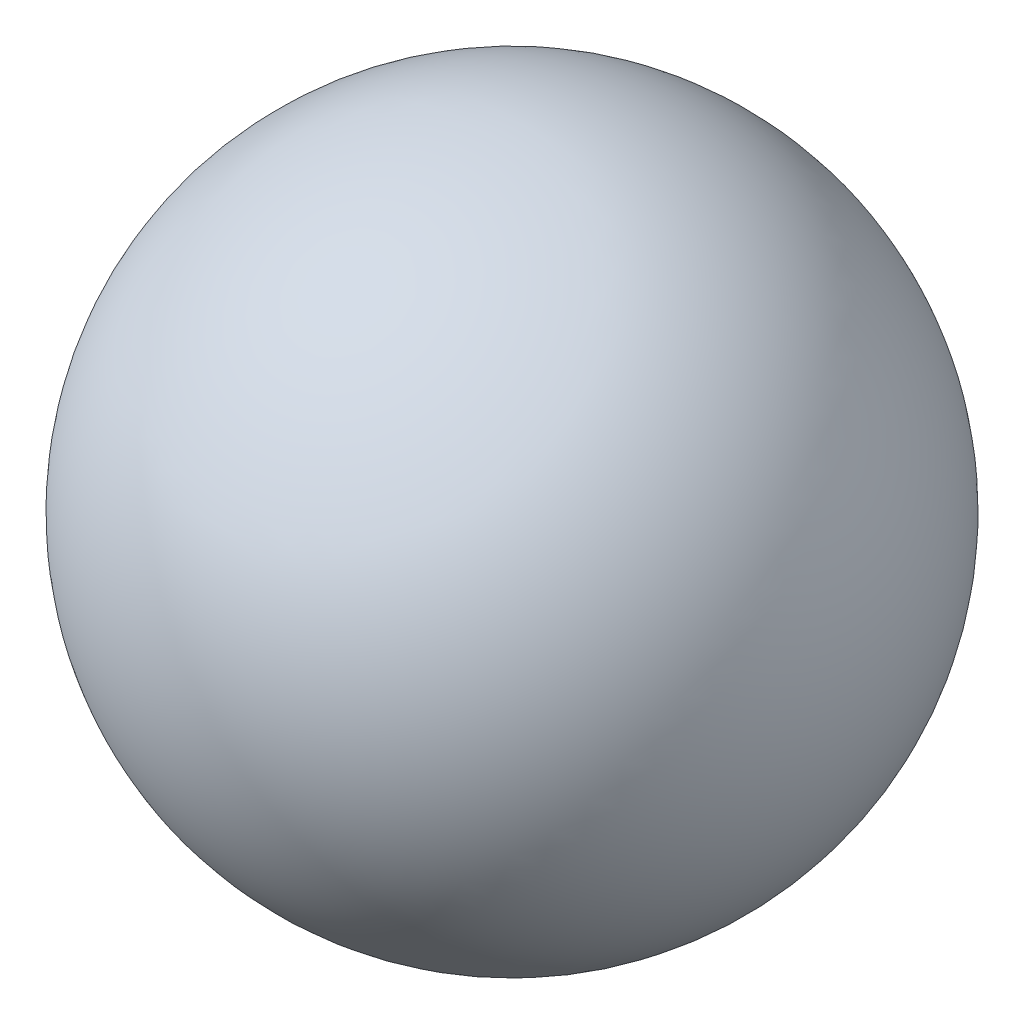
ISO-10303-21;
HEADER;
FILE_DESCRIPTION(('STEP AP214'),'2;1');
FILE_NAME('part.step','',(''),(''),'','','');
FILE_SCHEMA(('AUTOMOTIVE_DESIGN { 1 0 10303 214 1 1 1 1 }'));
ENDSEC;
DATA;
#1=APPLICATION_CONTEXT('core data for automotive mechanical design processes');
#2=APPLICATION_PROTOCOL_DEFINITION('international standard','automotive_design',2000,#1);
#3=PRODUCT_CONTEXT('',#1,'mechanical');
#4=PRODUCT('Part','Part','',(#3));
#5=PRODUCT_RELATED_PRODUCT_CATEGORY('part','',(#4));
#6=PRODUCT_DEFINITION_FORMATION('','',#4);
#7=PRODUCT_DEFINITION_CONTEXT('part definition',#1,'design');
#8=PRODUCT_DEFINITION('design','',#6,#7);
#9=PRODUCT_DEFINITION_SHAPE('','',#8);
#10=(LENGTH_UNIT() NAMED_UNIT(*) SI_UNIT(.MILLI.,.METRE.));
#11=(NAMED_UNIT(*) PLANE_ANGLE_UNIT() SI_UNIT($,.RADIAN.));
#12=(NAMED_UNIT(*) SI_UNIT($,.STERADIAN.) SOLID_ANGLE_UNIT());
#13=UNCERTAINTY_MEASURE_WITH_UNIT(LENGTH_MEASURE(1.E-05),#10,'distance_accuracy_value','');
#14=(GEOMETRIC_REPRESENTATION_CONTEXT(3) GLOBAL_UNCERTAINTY_ASSIGNED_CONTEXT((#13)) GLOBAL_UNIT_ASSIGNED_CONTEXT((#10,
#11,#12)) REPRESENTATION_CONTEXT('',''));
#15=CARTESIAN_POINT('',(0.,0.,0.));
#16=DIRECTION('',(0.,0.,1.));
#17=DIRECTION('',(1.,0.,0.));
#18=AXIS2_PLACEMENT_3D('',#15,#16,#17);
#19=CARTESIAN_POINT('',(7.26336808809212,-2.,-9.23612386322775));
#20=DIRECTION('',(0.,0.,1.));
#21=DIRECTION('',(1.,0.,0.));
#22=AXIS2_PLACEMENT_3D('',#19,#20,#21);
#23=SPHERICAL_SURFACE('',#22,1.05);
#24=CARTESIAN_POINT('',(7.26336808809212,-2.,-8.18612386322775));
#25=VERTEX_POINT('',#24);
#26=VERTEX_LOOP('',#25);
#27=FACE_BOUND('',#26,.T.);
#28=ADVANCED_FACE('F13',(#27),#23,.T.);
#29=CLOSED_SHELL('',(#28));
#30=MANIFOLD_SOLID_BREP('B1',#29);
#31=ADVANCED_BREP_SHAPE_REPRESENTATION('',(#18,#30),#14);
#32=SHAPE_DEFINITION_REPRESENTATION(#9,#31);
ENDSEC;
END-ISO-10303-21;
